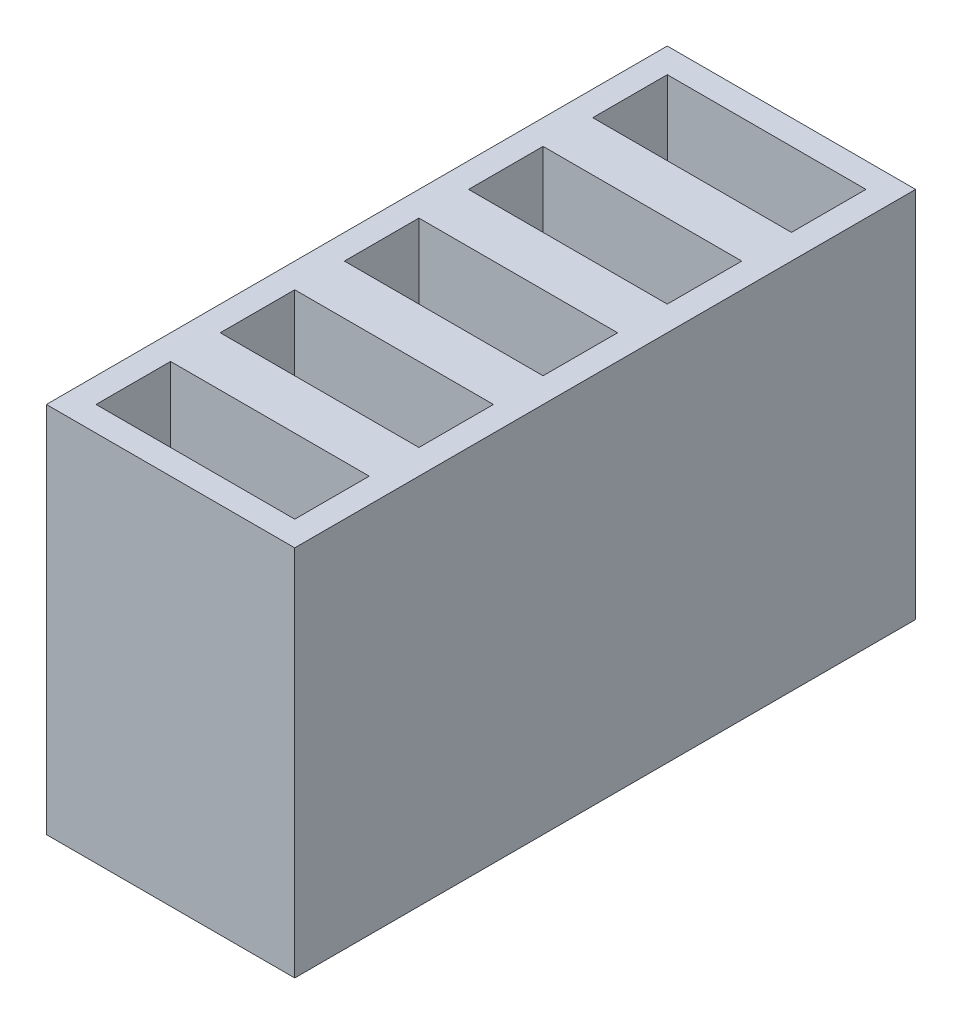
ISO-10303-21;
HEADER;
FILE_DESCRIPTION(('STEP AP214'),'2;1');
FILE_NAME('part.step','',(''),(''),'','','');
FILE_SCHEMA(('AUTOMOTIVE_DESIGN { 1 0 10303 214 1 1 1 1 }'));
ENDSEC;
DATA;
#1=APPLICATION_CONTEXT('core data for automotive mechanical design processes');
#2=APPLICATION_PROTOCOL_DEFINITION('international standard','automotive_design',2000,#1);
#3=PRODUCT_CONTEXT('',#1,'mechanical');
#4=PRODUCT('Part','Part','',(#3));
#5=PRODUCT_RELATED_PRODUCT_CATEGORY('part','',(#4));
#6=PRODUCT_DEFINITION_FORMATION('','',#4);
#7=PRODUCT_DEFINITION_CONTEXT('part definition',#1,'design');
#8=PRODUCT_DEFINITION('design','',#6,#7);
#9=PRODUCT_DEFINITION_SHAPE('','',#8);
#10=(LENGTH_UNIT() NAMED_UNIT(*) SI_UNIT(.MILLI.,.METRE.));
#11=(NAMED_UNIT(*) PLANE_ANGLE_UNIT() SI_UNIT($,.RADIAN.));
#12=(NAMED_UNIT(*) SI_UNIT($,.STERADIAN.) SOLID_ANGLE_UNIT());
#13=UNCERTAINTY_MEASURE_WITH_UNIT(LENGTH_MEASURE(1.E-05),#10,'distance_accuracy_value','');
#14=(GEOMETRIC_REPRESENTATION_CONTEXT(3) GLOBAL_UNCERTAINTY_ASSIGNED_CONTEXT((#13)) GLOBAL_UNIT_ASSIGNED_CONTEXT((#10,
#11,#12)) REPRESENTATION_CONTEXT('',''));
#15=CARTESIAN_POINT('',(0.,0.,0.));
#16=DIRECTION('',(0.,0.,1.));
#17=DIRECTION('',(1.,0.,0.));
#18=AXIS2_PLACEMENT_3D('',#15,#16,#17);
#19=CARTESIAN_POINT('',(-47.2100085491698,30.,-19.1167860740848));
#20=DIRECTION('',(1.,0.,0.));
#21=DIRECTION('',(0.,0.,-1.));
#22=AXIS2_PLACEMENT_3D('',#19,#20,#21);
#23=PLANE('',#22);
#24=DIRECTION('',(0.,0.,1.));
#25=VECTOR('',#24,1.);
#26=CARTESIAN_POINT('',(-47.2100085491698,0.,-19.1167860740848));
#27=LINE('',#26,#25);
#28=CARTESIAN_POINT('',(-47.2100085491698,0.,-19.1167860740848));
#29=VERTEX_POINT('',#28);
#30=CARTESIAN_POINT('',(-47.2100085491698,0.,30.8832139259152));
#31=VERTEX_POINT('',#30);
#32=EDGE_CURVE('E341',#29,#31,#27,.T.);
#33=ORIENTED_EDGE('',*,*,#32,.T.);
#34=DIRECTION('',(0.,-1.,0.));
#35=VECTOR('',#34,1.);
#36=CARTESIAN_POINT('',(-47.2100085491698,30.,30.8832139259152));
#37=LINE('',#36,#35);
#38=CARTESIAN_POINT('',(-47.2100085491698,30.,30.8832139259152));
#39=VERTEX_POINT('',#38);
#40=EDGE_CURVE('E12',#39,#31,#37,.T.);
#41=ORIENTED_EDGE('',*,*,#40,.F.);
#42=DIRECTION('',(0.,0.,1.));
#43=VECTOR('',#42,1.);
#44=CARTESIAN_POINT('',(-47.2100085491698,30.,-19.1167860740848));
#45=LINE('',#44,#43);
#46=CARTESIAN_POINT('',(-47.2100085491698,30.,-19.1167860740848));
#47=VERTEX_POINT('',#46);
#48=EDGE_CURVE('E342',#47,#39,#45,.T.);
#49=ORIENTED_EDGE('',*,*,#48,.F.);
#50=DIRECTION('',(0.,-1.,0.));
#51=VECTOR('',#50,1.);
#52=CARTESIAN_POINT('',(-47.2100085491698,30.,-19.1167860740848));
#53=LINE('',#52,#51);
#54=EDGE_CURVE('E352',#47,#29,#53,.T.);
#55=ORIENTED_EDGE('',*,*,#54,.T.);
#56=EDGE_LOOP('',(#33,#41,#49,#55));
#57=FACE_BOUND('',#56,.T.);
#58=ADVANCED_FACE('F35',(#57),#23,.F.);
#59=CARTESIAN_POINT('',(-47.2100085491698,30.,30.8832139259152));
#60=DIRECTION('',(0.,0.,-1.));
#61=DIRECTION('',(-1.,0.,0.));
#62=AXIS2_PLACEMENT_3D('',#59,#60,#61);
#63=PLANE('',#62);
#64=DIRECTION('',(1.,0.,0.));
#65=VECTOR('',#64,1.);
#66=CARTESIAN_POINT('',(-47.2100085491698,0.,30.8832139259152));
#67=LINE('',#66,#65);
#68=CARTESIAN_POINT('',(-27.2100085491698,0.,30.8832139259152));
#69=VERTEX_POINT('',#68);
#70=EDGE_CURVE('E355',#31,#69,#67,.T.);
#71=ORIENTED_EDGE('',*,*,#70,.T.);
#72=DIRECTION('',(0.,-1.,0.));
#73=VECTOR('',#72,1.);
#74=CARTESIAN_POINT('',(-27.2100085491698,30.,30.8832139259152));
#75=LINE('',#74,#73);
#76=CARTESIAN_POINT('',(-27.2100085491698,30.,30.8832139259152));
#77=VERTEX_POINT('',#76);
#78=EDGE_CURVE('E42',#77,#69,#75,.T.);
#79=ORIENTED_EDGE('',*,*,#78,.F.);
#80=DIRECTION('',(1.,0.,0.));
#81=VECTOR('',#80,1.);
#82=CARTESIAN_POINT('',(-47.2100085491698,30.,30.8832139259152));
#83=LINE('',#82,#81);
#84=EDGE_CURVE('E345',#39,#77,#83,.T.);
#85=ORIENTED_EDGE('',*,*,#84,.F.);
#86=ORIENTED_EDGE('',*,*,#40,.T.);
#87=EDGE_LOOP('',(#71,#79,#85,#86));
#88=FACE_BOUND('',#87,.T.);
#89=ADVANCED_FACE('F384',(#88),#63,.F.);
#90=CARTESIAN_POINT('',(-27.2100085491698,30.,-19.1167860740848));
#91=DIRECTION('',(-1.,0.,0.));
#92=DIRECTION('',(0.,0.,1.));
#93=AXIS2_PLACEMENT_3D('',#90,#91,#92);
#94=PLANE('',#93);
#95=DIRECTION('',(0.,0.,-1.));
#96=VECTOR('',#95,1.);
#97=CARTESIAN_POINT('',(-27.2100085491698,0.,-19.1167860740848));
#98=LINE('',#97,#96);
#99=CARTESIAN_POINT('',(-27.2100085491698,0.,-19.1167860740848));
#100=VERTEX_POINT('',#99);
#101=EDGE_CURVE('E357',#69,#100,#98,.T.);
#102=ORIENTED_EDGE('',*,*,#101,.T.);
#103=DIRECTION('',(0.,-1.,0.));
#104=VECTOR('',#103,1.);
#105=CARTESIAN_POINT('',(-27.2100085491698,30.,-19.1167860740848));
#106=LINE('',#105,#104);
#107=CARTESIAN_POINT('',(-27.2100085491698,30.,-19.1167860740848));
#108=VERTEX_POINT('',#107);
#109=EDGE_CURVE('E362',#108,#100,#106,.T.);
#110=ORIENTED_EDGE('',*,*,#109,.F.);
#111=DIRECTION('',(0.,0.,-1.));
#112=VECTOR('',#111,1.);
#113=CARTESIAN_POINT('',(-27.2100085491698,30.,-19.1167860740848));
#114=LINE('',#113,#112);
#115=EDGE_CURVE('E348',#77,#108,#114,.T.);
#116=ORIENTED_EDGE('',*,*,#115,.F.);
#117=ORIENTED_EDGE('',*,*,#78,.T.);
#118=EDGE_LOOP('',(#102,#110,#116,#117));
#119=FACE_BOUND('',#118,.T.);
#120=ADVANCED_FACE('F369',(#119),#94,.F.);
#121=CARTESIAN_POINT('',(-47.2100085491698,30.,-19.1167860740848));
#122=DIRECTION('',(0.,0.,1.));
#123=DIRECTION('',(1.,0.,0.));
#124=AXIS2_PLACEMENT_3D('',#121,#122,#123);
#125=PLANE('',#124);
#126=DIRECTION('',(-1.,0.,0.));
#127=VECTOR('',#126,1.);
#128=CARTESIAN_POINT('',(-47.2100085491698,0.,-19.1167860740848));
#129=LINE('',#128,#127);
#130=EDGE_CURVE('E346',#100,#29,#129,.T.);
#131=ORIENTED_EDGE('',*,*,#130,.T.);
#132=ORIENTED_EDGE('',*,*,#54,.F.);
#133=DIRECTION('',(-1.,0.,0.));
#134=VECTOR('',#133,1.);
#135=CARTESIAN_POINT('',(-47.2100085491698,30.,-19.1167860740848));
#136=LINE('',#135,#134);
#137=EDGE_CURVE('E350',#108,#47,#136,.T.);
#138=ORIENTED_EDGE('',*,*,#137,.F.);
#139=ORIENTED_EDGE('',*,*,#109,.T.);
#140=EDGE_LOOP('',(#131,#132,#138,#139));
#141=FACE_BOUND('',#140,.T.);
#142=ADVANCED_FACE('F378',(#141),#125,.F.);
#143=CARTESIAN_POINT('',(0.,30.,0.));
#144=DIRECTION('',(0.,1.,0.));
#145=DIRECTION('',(0.,0.,1.));
#146=AXIS2_PLACEMENT_3D('',#143,#144,#145);
#147=PLANE('',#146);
#148=DIRECTION('',(1.,0.,0.));
#149=VECTOR('',#148,1.);
#150=CARTESIAN_POINT('',(-45.2100085491698,30.,28.8832139259152));
#151=LINE('',#150,#149);
#152=CARTESIAN_POINT('',(-45.2100085491698,30.,28.8832139259152));
#153=VERTEX_POINT('',#152);
#154=CARTESIAN_POINT('',(-29.2100085491698,30.,28.8832139259152));
#155=VERTEX_POINT('',#154);
#156=EDGE_CURVE('E49',#153,#155,#151,.T.);
#157=ORIENTED_EDGE('',*,*,#156,.F.);
#158=DIRECTION('',(0.,0.,1.));
#159=VECTOR('',#158,1.);
#160=CARTESIAN_POINT('',(-45.2100085491698,30.,28.8832139259152));
#161=LINE('',#160,#159);
#162=CARTESIAN_POINT('',(-45.2100085491698,30.,22.8832139259152));
#163=VERTEX_POINT('',#162);
#164=EDGE_CURVE('E219',#163,#153,#161,.T.);
#165=ORIENTED_EDGE('',*,*,#164,.F.);
#166=DIRECTION('',(-1.,0.,0.));
#167=VECTOR('',#166,1.);
#168=CARTESIAN_POINT('',(-45.2100085491698,30.,22.8832139259152));
#169=LINE('',#168,#167);
#170=CARTESIAN_POINT('',(-29.2100085491698,30.,22.8832139259152));
#171=VERTEX_POINT('',#170);
#172=EDGE_CURVE('E202',#171,#163,#169,.T.);
#173=ORIENTED_EDGE('',*,*,#172,.F.);
#174=DIRECTION('',(0.,0.,-1.));
#175=VECTOR('',#174,1.);
#176=CARTESIAN_POINT('',(-29.2100085491698,30.,22.8832139259152));
#177=LINE('',#176,#175);
#178=EDGE_CURVE('E212',#155,#171,#177,.T.);
#179=ORIENTED_EDGE('',*,*,#178,.F.);
#180=EDGE_LOOP('',(#157,#165,#173,#179));
#181=FACE_BOUND('',#180,.T.);
#182=DIRECTION('',(1.,0.,0.));
#183=VECTOR('',#182,1.);
#184=CARTESIAN_POINT('',(-45.2100085491698,30.,8.88321392591523));
#185=LINE('',#184,#183);
#186=CARTESIAN_POINT('',(-45.2100085491698,30.,8.88321392591523));
#187=VERTEX_POINT('',#186);
#188=CARTESIAN_POINT('',(-29.2100085491698,30.,8.88321392591522));
#189=VERTEX_POINT('',#188);
#190=EDGE_CURVE('E57',#187,#189,#185,.T.);
#191=ORIENTED_EDGE('',*,*,#190,.F.);
#192=DIRECTION('',(0.,0.,1.));
#193=VECTOR('',#192,1.);
#194=CARTESIAN_POINT('',(-45.2100085491698,30.,8.88321392591523));
#195=LINE('',#194,#193);
#196=CARTESIAN_POINT('',(-45.2100085491698,30.,2.88321392591523));
#197=VERTEX_POINT('',#196);
#198=EDGE_CURVE('E246',#197,#187,#195,.T.);
#199=ORIENTED_EDGE('',*,*,#198,.F.);
#200=DIRECTION('',(-1.,0.,0.));
#201=VECTOR('',#200,1.);
#202=CARTESIAN_POINT('',(-45.2100085491698,30.,2.88321392591523));
#203=LINE('',#202,#201);
#204=CARTESIAN_POINT('',(-29.2100085491698,30.,2.88321392591523));
#205=VERTEX_POINT('',#204);
#206=EDGE_CURVE('E243',#205,#197,#203,.T.);
#207=ORIENTED_EDGE('',*,*,#206,.F.);
#208=DIRECTION('',(0.,0.,-1.));
#209=VECTOR('',#208,1.);
#210=CARTESIAN_POINT('',(-29.2100085491698,30.,2.88321392591523));
#211=LINE('',#210,#209);
#212=EDGE_CURVE('E240',#189,#205,#211,.T.);
#213=ORIENTED_EDGE('',*,*,#212,.F.);
#214=EDGE_LOOP('',(#191,#199,#207,#213));
#215=FACE_BOUND('',#214,.T.);
#216=DIRECTION('',(-1.,0.,0.));
#217=VECTOR('',#216,1.);
#218=CARTESIAN_POINT('',(-45.2100085491698,30.,12.8832139259152));
#219=LINE('',#218,#217);
#220=CARTESIAN_POINT('',(-29.2100085491698,30.,12.8832139259152));
#221=VERTEX_POINT('',#220);
#222=CARTESIAN_POINT('',(-45.2100085491698,30.,12.8832139259152));
#223=VERTEX_POINT('',#222);
#224=EDGE_CURVE('E257',#221,#223,#219,.T.);
#225=ORIENTED_EDGE('',*,*,#224,.F.);
#226=DIRECTION('',(0.,0.,-1.));
#227=VECTOR('',#226,1.);
#228=CARTESIAN_POINT('',(-29.2100085491698,30.,12.8832139259152));
#229=LINE('',#228,#227);
#230=CARTESIAN_POINT('',(-29.2100085491698,30.,18.8832139259152));
#231=VERTEX_POINT('',#230);
#232=EDGE_CURVE('E273',#231,#221,#229,.T.);
#233=ORIENTED_EDGE('',*,*,#232,.F.);
#234=DIRECTION('',(1.,0.,0.));
#235=VECTOR('',#234,1.);
#236=CARTESIAN_POINT('',(-45.2100085491698,30.,18.8832139259152));
#237=LINE('',#236,#235);
#238=CARTESIAN_POINT('',(-45.2100085491698,30.,18.8832139259152));
#239=VERTEX_POINT('',#238);
#240=EDGE_CURVE('E270',#239,#231,#237,.T.);
#241=ORIENTED_EDGE('',*,*,#240,.F.);
#242=DIRECTION('',(0.,0.,1.));
#243=VECTOR('',#242,1.);
#244=CARTESIAN_POINT('',(-45.2100085491698,30.,18.8832139259152));
#245=LINE('',#244,#243);
#246=EDGE_CURVE('E267',#223,#239,#245,.T.);
#247=ORIENTED_EDGE('',*,*,#246,.F.);
#248=EDGE_LOOP('',(#225,#233,#241,#247));
#249=FACE_BOUND('',#248,.T.);
#250=DIRECTION('',(1.,0.,0.));
#251=VECTOR('',#250,1.);
#252=CARTESIAN_POINT('',(-45.2100085491698,30.,-11.1167860740848));
#253=LINE('',#252,#251);
#254=CARTESIAN_POINT('',(-45.2100085491698,30.,-11.1167860740848));
#255=VERTEX_POINT('',#254);
#256=CARTESIAN_POINT('',(-29.2100085491698,30.,-11.1167860740848));
#257=VERTEX_POINT('',#256);
#258=EDGE_CURVE('E285',#255,#257,#253,.T.);
#259=ORIENTED_EDGE('',*,*,#258,.F.);
#260=DIRECTION('',(0.,0.,1.));
#261=VECTOR('',#260,1.);
#262=CARTESIAN_POINT('',(-45.2100085491698,30.,-11.1167860740848));
#263=LINE('',#262,#261);
#264=CARTESIAN_POINT('',(-45.2100085491698,30.,-17.1167860740848));
#265=VERTEX_POINT('',#264);
#266=EDGE_CURVE('E301',#265,#255,#263,.T.);
#267=ORIENTED_EDGE('',*,*,#266,.F.);
#268=DIRECTION('',(-1.,0.,0.));
#269=VECTOR('',#268,1.);
#270=CARTESIAN_POINT('',(-45.2100085491698,30.,-17.1167860740848));
#271=LINE('',#270,#269);
#272=CARTESIAN_POINT('',(-29.2100085491698,30.,-17.1167860740848));
#273=VERTEX_POINT('',#272);
#274=EDGE_CURVE('E298',#273,#265,#271,.T.);
#275=ORIENTED_EDGE('',*,*,#274,.F.);
#276=DIRECTION('',(0.,0.,-1.));
#277=VECTOR('',#276,1.);
#278=CARTESIAN_POINT('',(-29.2100085491698,30.,-17.1167860740848));
#279=LINE('',#278,#277);
#280=EDGE_CURVE('E295',#257,#273,#279,.T.);
#281=ORIENTED_EDGE('',*,*,#280,.F.);
#282=EDGE_LOOP('',(#259,#267,#275,#281));
#283=FACE_BOUND('',#282,.T.);
#284=DIRECTION('',(-1.,0.,0.));
#285=VECTOR('',#284,1.);
#286=CARTESIAN_POINT('',(-45.2100085491698,30.,-7.11678607408477));
#287=LINE('',#286,#285);
#288=CARTESIAN_POINT('',(-29.2100085491698,30.,-7.11678607408478));
#289=VERTEX_POINT('',#288);
#290=CARTESIAN_POINT('',(-45.2100085491698,30.,-7.11678607408477));
#291=VERTEX_POINT('',#290);
#292=EDGE_CURVE('E313',#289,#291,#287,.T.);
#293=ORIENTED_EDGE('',*,*,#292,.F.);
#294=DIRECTION('',(0.,0.,-1.));
#295=VECTOR('',#294,1.);
#296=CARTESIAN_POINT('',(-29.2100085491698,30.,-7.11678607408478));
#297=LINE('',#296,#295);
#298=CARTESIAN_POINT('',(-29.2100085491698,30.,-1.11678607408477));
#299=VERTEX_POINT('',#298);
#300=EDGE_CURVE('E329',#299,#289,#297,.T.);
#301=ORIENTED_EDGE('',*,*,#300,.F.);
#302=DIRECTION('',(1.,0.,0.));
#303=VECTOR('',#302,1.);
#304=CARTESIAN_POINT('',(-45.2100085491698,30.,-1.11678607408477));
#305=LINE('',#304,#303);
#306=CARTESIAN_POINT('',(-45.2100085491698,30.,-1.11678607408477));
#307=VERTEX_POINT('',#306);
#308=EDGE_CURVE('E326',#307,#299,#305,.T.);
#309=ORIENTED_EDGE('',*,*,#308,.F.);
#310=DIRECTION('',(0.,0.,1.));
#311=VECTOR('',#310,1.);
#312=CARTESIAN_POINT('',(-45.2100085491698,30.,-1.11678607408477));
#313=LINE('',#312,#311);
#314=EDGE_CURVE('E323',#291,#307,#313,.T.);
#315=ORIENTED_EDGE('',*,*,#314,.F.);
#316=EDGE_LOOP('',(#293,#301,#309,#315));
#317=FACE_BOUND('',#316,.T.);
#318=ORIENTED_EDGE('',*,*,#48,.T.);
#319=ORIENTED_EDGE('',*,*,#84,.T.);
#320=ORIENTED_EDGE('',*,*,#115,.T.);
#321=ORIENTED_EDGE('',*,*,#137,.T.);
#322=EDGE_LOOP('',(#318,#319,#320,#321));
#323=FACE_BOUND('',#322,.T.);
#324=ADVANCED_FACE('F216',(#181,#215,#249,#283,#317,#323),#147,.T.);
#325=CARTESIAN_POINT('',(0.,0.,0.));
#326=DIRECTION('',(0.,1.,0.));
#327=DIRECTION('',(0.,0.,1.));
#328=AXIS2_PLACEMENT_3D('',#325,#326,#327);
#329=PLANE('',#328);
#330=ORIENTED_EDGE('',*,*,#32,.F.);
#331=ORIENTED_EDGE('',*,*,#130,.F.);
#332=ORIENTED_EDGE('',*,*,#101,.F.);
#333=ORIENTED_EDGE('',*,*,#70,.F.);
#334=EDGE_LOOP('',(#330,#331,#332,#333));
#335=FACE_BOUND('',#334,.T.);
#336=ADVANCED_FACE('F375',(#335),#329,.F.);
#337=CARTESIAN_POINT('',(-45.2100085491698,-17.088007490635,-7.11678607408477));
#338=DIRECTION('',(0.,0.,-1.));
#339=DIRECTION('',(-1.,0.,0.));
#340=AXIS2_PLACEMENT_3D('',#337,#338,#339);
#341=PLANE('',#340);
#342=DIRECTION('',(1.,0.,0.));
#343=VECTOR('',#342,1.);
#344=CARTESIAN_POINT('',(-45.2100085491698,5.,-7.11678607408477));
#345=LINE('',#344,#343);
#346=CARTESIAN_POINT('',(-45.2100085491698,5.,-7.11678607408477));
#347=VERTEX_POINT('',#346);
#348=CARTESIAN_POINT('',(-29.2100085491698,5.,-7.11678607408478));
#349=VERTEX_POINT('',#348);
#350=EDGE_CURVE('E319',#347,#349,#345,.T.);
#351=ORIENTED_EDGE('',*,*,#350,.T.);
#352=DIRECTION('',(0.,1.,0.));
#353=VECTOR('',#352,1.);
#354=CARTESIAN_POINT('',(-29.2100085491698,-17.088007490635,-7.11678607408478));
#355=LINE('',#354,#353);
#356=EDGE_CURVE('E317',#349,#289,#355,.T.);
#357=ORIENTED_EDGE('',*,*,#356,.T.);
#358=ORIENTED_EDGE('',*,*,#292,.T.);
#359=DIRECTION('',(0.,1.,0.));
#360=VECTOR('',#359,1.);
#361=CARTESIAN_POINT('',(-45.2100085491698,-17.088007490635,-7.11678607408477));
#362=LINE('',#361,#360);
#363=EDGE_CURVE('E332',#347,#291,#362,.T.);
#364=ORIENTED_EDGE('',*,*,#363,.F.);
#365=EDGE_LOOP('',(#351,#357,#358,#364));
#366=FACE_BOUND('',#365,.T.);
#367=ADVANCED_FACE('F396',(#366),#341,.F.);
#368=CARTESIAN_POINT('',(-29.2100085491698,-17.088007490635,-7.11678607408478));
#369=DIRECTION('',(1.,0.,0.));
#370=DIRECTION('',(0.,0.,-1.));
#371=AXIS2_PLACEMENT_3D('',#368,#369,#370);
#372=PLANE('',#371);
#373=DIRECTION('',(0.,0.,1.));
#374=VECTOR('',#373,1.);
#375=CARTESIAN_POINT('',(-29.2100085491698,5.,-7.11678607408478));
#376=LINE('',#375,#374);
#377=CARTESIAN_POINT('',(-29.2100085491698,5.,-1.11678607408477));
#378=VERTEX_POINT('',#377);
#379=EDGE_CURVE('E316',#349,#378,#376,.T.);
#380=ORIENTED_EDGE('',*,*,#379,.T.);
#381=DIRECTION('',(0.,1.,0.));
#382=VECTOR('',#381,1.);
#383=CARTESIAN_POINT('',(-29.2100085491698,-17.088007490635,-1.11678607408477));
#384=LINE('',#383,#382);
#385=EDGE_CURVE('E334',#378,#299,#384,.T.);
#386=ORIENTED_EDGE('',*,*,#385,.T.);
#387=ORIENTED_EDGE('',*,*,#300,.T.);
#388=ORIENTED_EDGE('',*,*,#356,.F.);
#389=EDGE_LOOP('',(#380,#386,#387,#388));
#390=FACE_BOUND('',#389,.T.);
#391=ADVANCED_FACE('F401',(#390),#372,.F.);
#392=CARTESIAN_POINT('',(-45.2100085491698,-17.088007490635,-1.11678607408477));
#393=DIRECTION('',(0.,0.,1.));
#394=DIRECTION('',(1.,0.,0.));
#395=AXIS2_PLACEMENT_3D('',#392,#393,#394);
#396=PLANE('',#395);
#397=DIRECTION('',(-1.,0.,0.));
#398=VECTOR('',#397,1.);
#399=CARTESIAN_POINT('',(-45.2100085491698,5.,-1.11678607408477));
#400=LINE('',#399,#398);
#401=CARTESIAN_POINT('',(-45.2100085491698,4.99999999999999,-1.11678607408477));
#402=VERTEX_POINT('',#401);
#403=EDGE_CURVE('E314',#378,#402,#400,.T.);
#404=ORIENTED_EDGE('',*,*,#403,.T.);
#405=DIRECTION('',(0.,1.,0.));
#406=VECTOR('',#405,1.);
#407=CARTESIAN_POINT('',(-45.2100085491698,-17.088007490635,-1.11678607408477));
#408=LINE('',#407,#406);
#409=EDGE_CURVE('E336',#402,#307,#408,.T.);
#410=ORIENTED_EDGE('',*,*,#409,.T.);
#411=ORIENTED_EDGE('',*,*,#308,.T.);
#412=ORIENTED_EDGE('',*,*,#385,.F.);
#413=EDGE_LOOP('',(#404,#410,#411,#412));
#414=FACE_BOUND('',#413,.T.);
#415=ADVANCED_FACE('F407',(#414),#396,.F.);
#416=CARTESIAN_POINT('',(-45.2100085491698,-17.088007490635,-1.11678607408477));
#417=DIRECTION('',(-1.,0.,0.));
#418=DIRECTION('',(0.,0.,1.));
#419=AXIS2_PLACEMENT_3D('',#416,#417,#418);
#420=PLANE('',#419);
#421=DIRECTION('',(0.,0.,-1.));
#422=VECTOR('',#421,1.);
#423=CARTESIAN_POINT('',(-45.2100085491698,5.,-1.11678607408477));
#424=LINE('',#423,#422);
#425=EDGE_CURVE('E321',#402,#347,#424,.T.);
#426=ORIENTED_EDGE('',*,*,#425,.T.);
#427=ORIENTED_EDGE('',*,*,#363,.T.);
#428=ORIENTED_EDGE('',*,*,#314,.T.);
#429=ORIENTED_EDGE('',*,*,#409,.F.);
#430=EDGE_LOOP('',(#426,#427,#428,#429));
#431=FACE_BOUND('',#430,.T.);
#432=ADVANCED_FACE('F403',(#431),#420,.F.);
#433=CARTESIAN_POINT('',(0.,5.,0.));
#434=DIRECTION('',(0.,1.,0.));
#435=DIRECTION('',(0.,0.,1.));
#436=AXIS2_PLACEMENT_3D('',#433,#434,#435);
#437=PLANE('',#436);
#438=ORIENTED_EDGE('',*,*,#350,.F.);
#439=ORIENTED_EDGE('',*,*,#425,.F.);
#440=ORIENTED_EDGE('',*,*,#403,.F.);
#441=ORIENTED_EDGE('',*,*,#379,.F.);
#442=EDGE_LOOP('',(#438,#439,#440,#441));
#443=FACE_BOUND('',#442,.T.);
#444=ADVANCED_FACE('F406',(#443),#437,.T.);
#445=CARTESIAN_POINT('',(-45.2100085491698,-17.088007490635,-11.1167860740848));
#446=DIRECTION('',(0.,0.,1.));
#447=DIRECTION('',(1.,0.,0.));
#448=AXIS2_PLACEMENT_3D('',#445,#446,#447);
#449=PLANE('',#448);
#450=DIRECTION('',(-1.,0.,0.));
#451=VECTOR('',#450,1.);
#452=CARTESIAN_POINT('',(-45.2100085491698,5.,-11.1167860740848));
#453=LINE('',#452,#451);
#454=CARTESIAN_POINT('',(-29.2100085491698,5.,-11.1167860740848));
#455=VERTEX_POINT('',#454);
#456=CARTESIAN_POINT('',(-45.2100085491698,5.,-11.1167860740848));
#457=VERTEX_POINT('',#456);
#458=EDGE_CURVE('E291',#455,#457,#453,.T.);
#459=ORIENTED_EDGE('',*,*,#458,.T.);
#460=DIRECTION('',(0.,1.,0.));
#461=VECTOR('',#460,1.);
#462=CARTESIAN_POINT('',(-45.2100085491698,-17.088007490635,-11.1167860740848));
#463=LINE('',#462,#461);
#464=EDGE_CURVE('E289',#457,#255,#463,.T.);
#465=ORIENTED_EDGE('',*,*,#464,.T.);
#466=ORIENTED_EDGE('',*,*,#258,.T.);
#467=DIRECTION('',(0.,1.,0.));
#468=VECTOR('',#467,1.);
#469=CARTESIAN_POINT('',(-29.2100085491698,-17.088007490635,-11.1167860740848));
#470=LINE('',#469,#468);
#471=EDGE_CURVE('E304',#455,#257,#470,.T.);
#472=ORIENTED_EDGE('',*,*,#471,.F.);
#473=EDGE_LOOP('',(#459,#465,#466,#472));
#474=FACE_BOUND('',#473,.T.);
#475=ADVANCED_FACE('F417',(#474),#449,.F.);
#476=CARTESIAN_POINT('',(-45.2100085491698,-17.088007490635,-11.1167860740848));
#477=DIRECTION('',(-1.,0.,0.));
#478=DIRECTION('',(0.,0.,1.));
#479=AXIS2_PLACEMENT_3D('',#476,#477,#478);
#480=PLANE('',#479);
#481=DIRECTION('',(0.,0.,-1.));
#482=VECTOR('',#481,1.);
#483=CARTESIAN_POINT('',(-45.2100085491698,5.,-11.1167860740848));
#484=LINE('',#483,#482);
#485=CARTESIAN_POINT('',(-45.2100085491698,5.,-17.1167860740848));
#486=VERTEX_POINT('',#485);
#487=EDGE_CURVE('E288',#457,#486,#484,.T.);
#488=ORIENTED_EDGE('',*,*,#487,.T.);
#489=DIRECTION('',(0.,1.,0.));
#490=VECTOR('',#489,1.);
#491=CARTESIAN_POINT('',(-45.2100085491698,-17.088007490635,-17.1167860740848));
#492=LINE('',#491,#490);
#493=EDGE_CURVE('E306',#486,#265,#492,.T.);
#494=ORIENTED_EDGE('',*,*,#493,.T.);
#495=ORIENTED_EDGE('',*,*,#266,.T.);
#496=ORIENTED_EDGE('',*,*,#464,.F.);
#497=EDGE_LOOP('',(#488,#494,#495,#496));
#498=FACE_BOUND('',#497,.T.);
#499=ADVANCED_FACE('F421',(#498),#480,.F.);
#500=CARTESIAN_POINT('',(-45.2100085491698,-17.088007490635,-17.1167860740848));
#501=DIRECTION('',(0.,0.,-1.));
#502=DIRECTION('',(-1.,0.,0.));
#503=AXIS2_PLACEMENT_3D('',#500,#501,#502);
#504=PLANE('',#503);
#505=DIRECTION('',(1.,0.,0.));
#506=VECTOR('',#505,1.);
#507=CARTESIAN_POINT('',(-45.2100085491698,5.,-17.1167860740848));
#508=LINE('',#507,#506);
#509=CARTESIAN_POINT('',(-29.2100085491698,4.99999999999999,-17.1167860740848));
#510=VERTEX_POINT('',#509);
#511=EDGE_CURVE('E286',#486,#510,#508,.T.);
#512=ORIENTED_EDGE('',*,*,#511,.T.);
#513=DIRECTION('',(0.,1.,0.));
#514=VECTOR('',#513,1.);
#515=CARTESIAN_POINT('',(-29.2100085491698,-17.088007490635,-17.1167860740848));
#516=LINE('',#515,#514);
#517=EDGE_CURVE('E308',#510,#273,#516,.T.);
#518=ORIENTED_EDGE('',*,*,#517,.T.);
#519=ORIENTED_EDGE('',*,*,#274,.T.);
#520=ORIENTED_EDGE('',*,*,#493,.F.);
#521=EDGE_LOOP('',(#512,#518,#519,#520));
#522=FACE_BOUND('',#521,.T.);
#523=ADVANCED_FACE('F427',(#522),#504,.F.);
#524=CARTESIAN_POINT('',(-29.2100085491698,-17.088007490635,-17.1167860740848));
#525=DIRECTION('',(1.,0.,0.));
#526=DIRECTION('',(0.,0.,-1.));
#527=AXIS2_PLACEMENT_3D('',#524,#525,#526);
#528=PLANE('',#527);
#529=DIRECTION('',(0.,0.,1.));
#530=VECTOR('',#529,1.);
#531=CARTESIAN_POINT('',(-29.2100085491698,5.,-17.1167860740848));
#532=LINE('',#531,#530);
#533=EDGE_CURVE('E293',#510,#455,#532,.T.);
#534=ORIENTED_EDGE('',*,*,#533,.T.);
#535=ORIENTED_EDGE('',*,*,#471,.T.);
#536=ORIENTED_EDGE('',*,*,#280,.T.);
#537=ORIENTED_EDGE('',*,*,#517,.F.);
#538=EDGE_LOOP('',(#534,#535,#536,#537));
#539=FACE_BOUND('',#538,.T.);
#540=ADVANCED_FACE('F423',(#539),#528,.F.);
#541=CARTESIAN_POINT('',(0.,5.,0.));
#542=DIRECTION('',(0.,1.,0.));
#543=DIRECTION('',(0.,0.,1.));
#544=AXIS2_PLACEMENT_3D('',#541,#542,#543);
#545=PLANE('',#544);
#546=ORIENTED_EDGE('',*,*,#458,.F.);
#547=ORIENTED_EDGE('',*,*,#533,.F.);
#548=ORIENTED_EDGE('',*,*,#511,.F.);
#549=ORIENTED_EDGE('',*,*,#487,.F.);
#550=EDGE_LOOP('',(#546,#547,#548,#549));
#551=FACE_BOUND('',#550,.T.);
#552=ADVANCED_FACE('F426',(#551),#545,.T.);
#553=CARTESIAN_POINT('',(-45.2100085491698,-17.088007490635,12.8832139259152));
#554=DIRECTION('',(0.,0.,-1.));
#555=DIRECTION('',(-1.,0.,0.));
#556=AXIS2_PLACEMENT_3D('',#553,#554,#555);
#557=PLANE('',#556);
#558=DIRECTION('',(1.,0.,0.));
#559=VECTOR('',#558,1.);
#560=CARTESIAN_POINT('',(-45.2100085491698,5.,12.8832139259152));
#561=LINE('',#560,#559);
#562=CARTESIAN_POINT('',(-45.2100085491698,5.,12.8832139259152));
#563=VERTEX_POINT('',#562);
#564=CARTESIAN_POINT('',(-29.2100085491698,5.,12.8832139259152));
#565=VERTEX_POINT('',#564);
#566=EDGE_CURVE('E263',#563,#565,#561,.T.);
#567=ORIENTED_EDGE('',*,*,#566,.T.);
#568=DIRECTION('',(0.,1.,0.));
#569=VECTOR('',#568,1.);
#570=CARTESIAN_POINT('',(-29.2100085491698,-17.088007490635,12.8832139259152));
#571=LINE('',#570,#569);
#572=EDGE_CURVE('E261',#565,#221,#571,.T.);
#573=ORIENTED_EDGE('',*,*,#572,.T.);
#574=ORIENTED_EDGE('',*,*,#224,.T.);
#575=DIRECTION('',(0.,1.,0.));
#576=VECTOR('',#575,1.);
#577=CARTESIAN_POINT('',(-45.2100085491698,-17.088007490635,12.8832139259152));
#578=LINE('',#577,#576);
#579=EDGE_CURVE('E276',#563,#223,#578,.T.);
#580=ORIENTED_EDGE('',*,*,#579,.F.);
#581=EDGE_LOOP('',(#567,#573,#574,#580));
#582=FACE_BOUND('',#581,.T.);
#583=ADVANCED_FACE('F437',(#582),#557,.F.);
#584=CARTESIAN_POINT('',(-29.2100085491698,-17.088007490635,12.8832139259152));
#585=DIRECTION('',(1.,0.,0.));
#586=DIRECTION('',(0.,0.,-1.));
#587=AXIS2_PLACEMENT_3D('',#584,#585,#586);
#588=PLANE('',#587);
#589=DIRECTION('',(0.,0.,1.));
#590=VECTOR('',#589,1.);
#591=CARTESIAN_POINT('',(-29.2100085491698,5.,12.8832139259152));
#592=LINE('',#591,#590);
#593=CARTESIAN_POINT('',(-29.2100085491698,5.,18.8832139259152));
#594=VERTEX_POINT('',#593);
#595=EDGE_CURVE('E260',#565,#594,#592,.T.);
#596=ORIENTED_EDGE('',*,*,#595,.T.);
#597=DIRECTION('',(0.,1.,0.));
#598=VECTOR('',#597,1.);
#599=CARTESIAN_POINT('',(-29.2100085491698,-17.088007490635,18.8832139259152));
#600=LINE('',#599,#598);
#601=EDGE_CURVE('E278',#594,#231,#600,.T.);
#602=ORIENTED_EDGE('',*,*,#601,.T.);
#603=ORIENTED_EDGE('',*,*,#232,.T.);
#604=ORIENTED_EDGE('',*,*,#572,.F.);
#605=EDGE_LOOP('',(#596,#602,#603,#604));
#606=FACE_BOUND('',#605,.T.);
#607=ADVANCED_FACE('F441',(#606),#588,.F.);
#608=CARTESIAN_POINT('',(-45.2100085491698,-17.088007490635,18.8832139259152));
#609=DIRECTION('',(0.,0.,1.));
#610=DIRECTION('',(1.,0.,0.));
#611=AXIS2_PLACEMENT_3D('',#608,#609,#610);
#612=PLANE('',#611);
#613=DIRECTION('',(-1.,0.,0.));
#614=VECTOR('',#613,1.);
#615=CARTESIAN_POINT('',(-45.2100085491698,5.,18.8832139259152));
#616=LINE('',#615,#614);
#617=CARTESIAN_POINT('',(-45.2100085491698,4.99999999999999,18.8832139259152));
#618=VERTEX_POINT('',#617);
#619=EDGE_CURVE('E258',#594,#618,#616,.T.);
#620=ORIENTED_EDGE('',*,*,#619,.T.);
#621=DIRECTION('',(0.,1.,0.));
#622=VECTOR('',#621,1.);
#623=CARTESIAN_POINT('',(-45.2100085491698,-17.088007490635,18.8832139259152));
#624=LINE('',#623,#622);
#625=EDGE_CURVE('E280',#618,#239,#624,.T.);
#626=ORIENTED_EDGE('',*,*,#625,.T.);
#627=ORIENTED_EDGE('',*,*,#240,.T.);
#628=ORIENTED_EDGE('',*,*,#601,.F.);
#629=EDGE_LOOP('',(#620,#626,#627,#628));
#630=FACE_BOUND('',#629,.T.);
#631=ADVANCED_FACE('F447',(#630),#612,.F.);
#632=CARTESIAN_POINT('',(-45.2100085491698,-17.088007490635,18.8832139259152));
#633=DIRECTION('',(-1.,0.,0.));
#634=DIRECTION('',(0.,0.,1.));
#635=AXIS2_PLACEMENT_3D('',#632,#633,#634);
#636=PLANE('',#635);
#637=DIRECTION('',(0.,0.,-1.));
#638=VECTOR('',#637,1.);
#639=CARTESIAN_POINT('',(-45.2100085491698,5.,18.8832139259152));
#640=LINE('',#639,#638);
#641=EDGE_CURVE('E265',#618,#563,#640,.T.);
#642=ORIENTED_EDGE('',*,*,#641,.T.);
#643=ORIENTED_EDGE('',*,*,#579,.T.);
#644=ORIENTED_EDGE('',*,*,#246,.T.);
#645=ORIENTED_EDGE('',*,*,#625,.F.);
#646=EDGE_LOOP('',(#642,#643,#644,#645));
#647=FACE_BOUND('',#646,.T.);
#648=ADVANCED_FACE('F443',(#647),#636,.F.);
#649=CARTESIAN_POINT('',(0.,5.,0.));
#650=DIRECTION('',(0.,1.,0.));
#651=DIRECTION('',(0.,0.,1.));
#652=AXIS2_PLACEMENT_3D('',#649,#650,#651);
#653=PLANE('',#652);
#654=ORIENTED_EDGE('',*,*,#566,.F.);
#655=ORIENTED_EDGE('',*,*,#641,.F.);
#656=ORIENTED_EDGE('',*,*,#619,.F.);
#657=ORIENTED_EDGE('',*,*,#595,.F.);
#658=EDGE_LOOP('',(#654,#655,#656,#657));
#659=FACE_BOUND('',#658,.T.);
#660=ADVANCED_FACE('F446',(#659),#653,.T.);
#661=CARTESIAN_POINT('',(-45.2100085491698,-17.088007490635,8.88321392591523));
#662=DIRECTION('',(0.,0.,1.));
#663=DIRECTION('',(1.,0.,0.));
#664=AXIS2_PLACEMENT_3D('',#661,#662,#663);
#665=PLANE('',#664);
#666=DIRECTION('',(-1.,0.,0.));
#667=VECTOR('',#666,1.);
#668=CARTESIAN_POINT('',(-45.2100085491698,5.,8.88321392591523));
#669=LINE('',#668,#667);
#670=CARTESIAN_POINT('',(-29.2100085491698,5.,8.88321392591522));
#671=VERTEX_POINT('',#670);
#672=CARTESIAN_POINT('',(-45.2100085491698,5.,8.88321392591523));
#673=VERTEX_POINT('',#672);
#674=EDGE_CURVE('E236',#671,#673,#669,.T.);
#675=ORIENTED_EDGE('',*,*,#674,.T.);
#676=DIRECTION('',(0.,1.,0.));
#677=VECTOR('',#676,1.);
#678=CARTESIAN_POINT('',(-45.2100085491698,-17.088007490635,8.88321392591523));
#679=LINE('',#678,#677);
#680=EDGE_CURVE('E234',#673,#187,#679,.T.);
#681=ORIENTED_EDGE('',*,*,#680,.T.);
#682=ORIENTED_EDGE('',*,*,#190,.T.);
#683=DIRECTION('',(0.,1.,0.));
#684=VECTOR('',#683,1.);
#685=CARTESIAN_POINT('',(-29.2100085491698,-17.088007490635,8.88321392591522));
#686=LINE('',#685,#684);
#687=EDGE_CURVE('E249',#671,#189,#686,.T.);
#688=ORIENTED_EDGE('',*,*,#687,.F.);
#689=EDGE_LOOP('',(#675,#681,#682,#688));
#690=FACE_BOUND('',#689,.T.);
#691=ADVANCED_FACE('F457',(#690),#665,.F.);
#692=CARTESIAN_POINT('',(-45.2100085491698,-17.088007490635,8.88321392591523));
#693=DIRECTION('',(-1.,0.,0.));
#694=DIRECTION('',(0.,0.,1.));
#695=AXIS2_PLACEMENT_3D('',#692,#693,#694);
#696=PLANE('',#695);
#697=DIRECTION('',(0.,0.,-1.));
#698=VECTOR('',#697,1.);
#699=CARTESIAN_POINT('',(-45.2100085491698,5.,8.88321392591523));
#700=LINE('',#699,#698);
#701=CARTESIAN_POINT('',(-45.2100085491698,5.,2.88321392591523));
#702=VERTEX_POINT('',#701);
#703=EDGE_CURVE('E233',#673,#702,#700,.T.);
#704=ORIENTED_EDGE('',*,*,#703,.T.);
#705=DIRECTION('',(0.,1.,0.));
#706=VECTOR('',#705,1.);
#707=CARTESIAN_POINT('',(-45.2100085491698,-17.088007490635,2.88321392591523));
#708=LINE('',#707,#706);
#709=EDGE_CURVE('E251',#702,#197,#708,.T.);
#710=ORIENTED_EDGE('',*,*,#709,.T.);
#711=ORIENTED_EDGE('',*,*,#198,.T.);
#712=ORIENTED_EDGE('',*,*,#680,.F.);
#713=EDGE_LOOP('',(#704,#710,#711,#712));
#714=FACE_BOUND('',#713,.T.);
#715=ADVANCED_FACE('F461',(#714),#696,.F.);
#716=CARTESIAN_POINT('',(-45.2100085491698,-17.088007490635,2.88321392591523));
#717=DIRECTION('',(0.,0.,-1.));
#718=DIRECTION('',(-1.,0.,0.));
#719=AXIS2_PLACEMENT_3D('',#716,#717,#718);
#720=PLANE('',#719);
#721=DIRECTION('',(1.,0.,0.));
#722=VECTOR('',#721,1.);
#723=CARTESIAN_POINT('',(-45.2100085491698,5.,2.88321392591523));
#724=LINE('',#723,#722);
#725=CARTESIAN_POINT('',(-29.2100085491698,4.99999999999999,2.88321392591523));
#726=VERTEX_POINT('',#725);
#727=EDGE_CURVE('E231',#702,#726,#724,.T.);
#728=ORIENTED_EDGE('',*,*,#727,.T.);
#729=DIRECTION('',(0.,1.,0.));
#730=VECTOR('',#729,1.);
#731=CARTESIAN_POINT('',(-29.2100085491698,-17.088007490635,2.88321392591523));
#732=LINE('',#731,#730);
#733=EDGE_CURVE('E253',#726,#205,#732,.T.);
#734=ORIENTED_EDGE('',*,*,#733,.T.);
#735=ORIENTED_EDGE('',*,*,#206,.T.);
#736=ORIENTED_EDGE('',*,*,#709,.F.);
#737=EDGE_LOOP('',(#728,#734,#735,#736));
#738=FACE_BOUND('',#737,.T.);
#739=ADVANCED_FACE('F466',(#738),#720,.F.);
#740=CARTESIAN_POINT('',(-29.2100085491698,-17.088007490635,2.88321392591523));
#741=DIRECTION('',(1.,0.,0.));
#742=DIRECTION('',(0.,0.,-1.));
#743=AXIS2_PLACEMENT_3D('',#740,#741,#742);
#744=PLANE('',#743);
#745=DIRECTION('',(0.,0.,1.));
#746=VECTOR('',#745,1.);
#747=CARTESIAN_POINT('',(-29.2100085491698,5.,2.88321392591523));
#748=LINE('',#747,#746);
#749=EDGE_CURVE('E238',#726,#671,#748,.T.);
#750=ORIENTED_EDGE('',*,*,#749,.T.);
#751=ORIENTED_EDGE('',*,*,#687,.T.);
#752=ORIENTED_EDGE('',*,*,#212,.T.);
#753=ORIENTED_EDGE('',*,*,#733,.F.);
#754=EDGE_LOOP('',(#750,#751,#752,#753));
#755=FACE_BOUND('',#754,.T.);
#756=ADVANCED_FACE('F462',(#755),#744,.F.);
#757=CARTESIAN_POINT('',(0.,5.,0.));
#758=DIRECTION('',(0.,1.,0.));
#759=DIRECTION('',(0.,0.,1.));
#760=AXIS2_PLACEMENT_3D('',#757,#758,#759);
#761=PLANE('',#760);
#762=ORIENTED_EDGE('',*,*,#674,.F.);
#763=ORIENTED_EDGE('',*,*,#749,.F.);
#764=ORIENTED_EDGE('',*,*,#727,.F.);
#765=ORIENTED_EDGE('',*,*,#703,.F.);
#766=EDGE_LOOP('',(#762,#763,#764,#765));
#767=FACE_BOUND('',#766,.T.);
#768=ADVANCED_FACE('F465',(#767),#761,.T.);
#769=CARTESIAN_POINT('',(-45.2100085491698,-17.088007490635,28.8832139259152));
#770=DIRECTION('',(0.,0.,1.));
#771=DIRECTION('',(1.,0.,0.));
#772=AXIS2_PLACEMENT_3D('',#769,#770,#771);
#773=PLANE('',#772);
#774=DIRECTION('',(-1.,0.,0.));
#775=VECTOR('',#774,1.);
#776=CARTESIAN_POINT('',(-45.2100085491698,5.,28.8832139259152));
#777=LINE('',#776,#775);
#778=CARTESIAN_POINT('',(-29.2100085491698,5.,28.8832139259152));
#779=VERTEX_POINT('',#778);
#780=CARTESIAN_POINT('',(-45.2100085491698,5.,28.8832139259152));
#781=VERTEX_POINT('',#780);
#782=EDGE_CURVE('E230',#779,#781,#777,.T.);
#783=ORIENTED_EDGE('',*,*,#782,.T.);
#784=DIRECTION('',(0.,1.,0.));
#785=VECTOR('',#784,1.);
#786=CARTESIAN_POINT('',(-45.2100085491698,-17.088007490635,28.8832139259152));
#787=LINE('',#786,#785);
#788=EDGE_CURVE('E224',#781,#153,#787,.T.);
#789=ORIENTED_EDGE('',*,*,#788,.T.);
#790=ORIENTED_EDGE('',*,*,#156,.T.);
#791=DIRECTION('',(0.,1.,0.));
#792=VECTOR('',#791,1.);
#793=CARTESIAN_POINT('',(-29.2100085491698,-17.088007490635,28.8832139259152));
#794=LINE('',#793,#792);
#795=EDGE_CURVE('E209',#779,#155,#794,.T.);
#796=ORIENTED_EDGE('',*,*,#795,.F.);
#797=EDGE_LOOP('',(#783,#789,#790,#796));
#798=FACE_BOUND('',#797,.T.);
#799=ADVANCED_FACE('F476',(#798),#773,.F.);
#800=CARTESIAN_POINT('',(-45.2100085491698,-17.088007490635,28.8832139259152));
#801=DIRECTION('',(-1.,0.,0.));
#802=DIRECTION('',(0.,0.,1.));
#803=AXIS2_PLACEMENT_3D('',#800,#801,#802);
#804=PLANE('',#803);
#805=DIRECTION('',(0.,0.,-1.));
#806=VECTOR('',#805,1.);
#807=CARTESIAN_POINT('',(-45.2100085491698,5.,28.8832139259152));
#808=LINE('',#807,#806);
#809=CARTESIAN_POINT('',(-45.2100085491698,5.,22.8832139259152));
#810=VERTEX_POINT('',#809);
#811=EDGE_CURVE('E495',#781,#810,#808,.T.);
#812=ORIENTED_EDGE('',*,*,#811,.T.);
#813=DIRECTION('',(0.,1.,0.));
#814=VECTOR('',#813,1.);
#815=CARTESIAN_POINT('',(-45.2100085491698,-17.088007490635,22.8832139259152));
#816=LINE('',#815,#814);
#817=EDGE_CURVE('E208',#810,#163,#816,.T.);
#818=ORIENTED_EDGE('',*,*,#817,.T.);
#819=ORIENTED_EDGE('',*,*,#164,.T.);
#820=ORIENTED_EDGE('',*,*,#788,.F.);
#821=EDGE_LOOP('',(#812,#818,#819,#820));
#822=FACE_BOUND('',#821,.T.);
#823=ADVANCED_FACE('F480',(#822),#804,.F.);
#824=CARTESIAN_POINT('',(-45.2100085491698,-17.088007490635,22.8832139259152));
#825=DIRECTION('',(0.,0.,-1.));
#826=DIRECTION('',(-1.,0.,0.));
#827=AXIS2_PLACEMENT_3D('',#824,#825,#826);
#828=PLANE('',#827);
#829=DIRECTION('',(1.,0.,0.));
#830=VECTOR('',#829,1.);
#831=CARTESIAN_POINT('',(-45.2100085491698,5.,22.8832139259152));
#832=LINE('',#831,#830);
#833=CARTESIAN_POINT('',(-29.2100085491698,4.99999999999999,22.8832139259152));
#834=VERTEX_POINT('',#833);
#835=EDGE_CURVE('E205',#810,#834,#832,.T.);
#836=ORIENTED_EDGE('',*,*,#835,.T.);
#837=DIRECTION('',(0.,1.,0.));
#838=VECTOR('',#837,1.);
#839=CARTESIAN_POINT('',(-29.2100085491698,-17.088007490635,22.8832139259152));
#840=LINE('',#839,#838);
#841=EDGE_CURVE('E197',#834,#171,#840,.T.);
#842=ORIENTED_EDGE('',*,*,#841,.T.);
#843=ORIENTED_EDGE('',*,*,#172,.T.);
#844=ORIENTED_EDGE('',*,*,#817,.F.);
#845=EDGE_LOOP('',(#836,#842,#843,#844));
#846=FACE_BOUND('',#845,.T.);
#847=ADVANCED_FACE('F199',(#846),#828,.F.);
#848=CARTESIAN_POINT('',(-29.2100085491698,-17.088007490635,22.8832139259152));
#849=DIRECTION('',(1.,0.,0.));
#850=DIRECTION('',(0.,0.,-1.));
#851=AXIS2_PLACEMENT_3D('',#848,#849,#850);
#852=PLANE('',#851);
#853=DIRECTION('',(0.,0.,1.));
#854=VECTOR('',#853,1.);
#855=CARTESIAN_POINT('',(-29.2100085491698,5.,22.8832139259152));
#856=LINE('',#855,#854);
#857=EDGE_CURVE('E228',#834,#779,#856,.T.);
#858=ORIENTED_EDGE('',*,*,#857,.T.);
#859=ORIENTED_EDGE('',*,*,#795,.T.);
#860=ORIENTED_EDGE('',*,*,#178,.T.);
#861=ORIENTED_EDGE('',*,*,#841,.F.);
#862=EDGE_LOOP('',(#858,#859,#860,#861));
#863=FACE_BOUND('',#862,.T.);
#864=ADVANCED_FACE('F213',(#863),#852,.F.);
#865=CARTESIAN_POINT('',(0.,5.,0.));
#866=DIRECTION('',(0.,1.,0.));
#867=DIRECTION('',(0.,0.,1.));
#868=AXIS2_PLACEMENT_3D('',#865,#866,#867);
#869=PLANE('',#868);
#870=ORIENTED_EDGE('',*,*,#782,.F.);
#871=ORIENTED_EDGE('',*,*,#857,.F.);
#872=ORIENTED_EDGE('',*,*,#835,.F.);
#873=ORIENTED_EDGE('',*,*,#811,.F.);
#874=EDGE_LOOP('',(#870,#871,#872,#873));
#875=FACE_BOUND('',#874,.T.);
#876=ADVANCED_FACE('F483',(#875),#869,.T.);
#877=CLOSED_SHELL('',(#58,#89,#120,#142,#324,#336,#367,#391,#415,#432,#444,#475,#499,#523,#540,
#552,#583,#607,#631,#648,#660,#691,#715,#739,#756,#768,#799,#823,#847,#864,#876));
#878=MANIFOLD_SOLID_BREP('B2',#877);
#879=ADVANCED_BREP_SHAPE_REPRESENTATION('',(#18,#878),#14);
#880=SHAPE_DEFINITION_REPRESENTATION(#9,#879);
ENDSEC;
END-ISO-10303-21;
